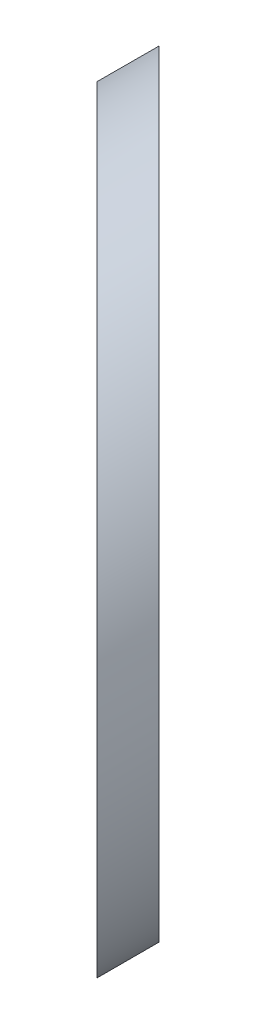
ISO-10303-21;
HEADER;
FILE_DESCRIPTION(('STEP AP214'),'2;1');
FILE_NAME('part.step','',(''),(''),'','','');
FILE_SCHEMA(('AUTOMOTIVE_DESIGN { 1 0 10303 214 1 1 1 1 }'));
ENDSEC;
DATA;
#1=APPLICATION_CONTEXT('core data for automotive mechanical design processes');
#2=APPLICATION_PROTOCOL_DEFINITION('international standard','automotive_design',2000,#1);
#3=PRODUCT_CONTEXT('',#1,'mechanical');
#4=PRODUCT('Part','Part','',(#3));
#5=PRODUCT_RELATED_PRODUCT_CATEGORY('part','',(#4));
#6=PRODUCT_DEFINITION_FORMATION('','',#4);
#7=PRODUCT_DEFINITION_CONTEXT('part definition',#1,'design');
#8=PRODUCT_DEFINITION('design','',#6,#7);
#9=PRODUCT_DEFINITION_SHAPE('','',#8);
#10=(LENGTH_UNIT() NAMED_UNIT(*) SI_UNIT(.MILLI.,.METRE.));
#11=(NAMED_UNIT(*) PLANE_ANGLE_UNIT() SI_UNIT($,.RADIAN.));
#12=(NAMED_UNIT(*) SI_UNIT($,.STERADIAN.) SOLID_ANGLE_UNIT());
#13=UNCERTAINTY_MEASURE_WITH_UNIT(LENGTH_MEASURE(1.E-05),#10,'distance_accuracy_value','');
#14=(GEOMETRIC_REPRESENTATION_CONTEXT(3) GLOBAL_UNCERTAINTY_ASSIGNED_CONTEXT((#13)) GLOBAL_UNIT_ASSIGNED_CONTEXT((#10,
#11,#12)) REPRESENTATION_CONTEXT('',''));
#15=CARTESIAN_POINT('',(0.,0.,0.));
#16=DIRECTION('',(0.,0.,1.));
#17=DIRECTION('',(1.,0.,0.));
#18=AXIS2_PLACEMENT_3D('',#15,#16,#17);
#19=CARTESIAN_POINT('',(0.,0.,61.));
#20=DIRECTION('',(0.,0.,-1.));
#21=DIRECTION('',(-1.,0.,0.));
#22=AXIS2_PLACEMENT_3D('',#19,#20,#21);
#23=CYLINDRICAL_SURFACE('',#22,6.25);
#24=CARTESIAN_POINT('',(0.,0.,19.4480630350569));
#25=DIRECTION('',(0.707106781186546,0.,-0.707106781186549));
#26=DIRECTION('',(-0.707106781186549,0.,-0.707106781186546));
#27=AXIS2_PLACEMENT_3D('',#24,#25,#26);
#28=ELLIPSE('',#27,8.83883476483183,6.25);
#29=CARTESIAN_POINT('',(-6.25,0.,13.1980630350569));
#30=VERTEX_POINT('',#29);
#31=EDGE_CURVE('E12',#30,#30,#28,.T.);
#32=ORIENTED_EDGE('',*,*,#31,.T.);
#33=EDGE_LOOP('',(#32));
#34=FACE_BOUND('',#33,.T.);
#35=CARTESIAN_POINT('',(0.,0.,18.0338494726838));
#36=DIRECTION('',(-0.707106781186546,0.,0.707106781186549));
#37=DIRECTION('',(-0.707106781186549,0.,-0.707106781186546));
#38=AXIS2_PLACEMENT_3D('',#35,#36,#37);
#39=ELLIPSE('',#38,8.83883476483183,6.25);
#40=CARTESIAN_POINT('',(-6.25,0.,11.7838494726838));
#41=VERTEX_POINT('',#40);
#42=EDGE_CURVE('E60',#41,#41,#39,.T.);
#43=ORIENTED_EDGE('',*,*,#42,.T.);
#44=EDGE_LOOP('',(#43));
#45=FACE_BOUND('',#44,.T.);
#46=ADVANCED_FACE('F53',(#34,#45),#23,.T.);
#47=CARTESIAN_POINT('',(-39.378340461429,-30.5,-21.3444909887451));
#48=DIRECTION('',(-0.707106781186546,0.,0.707106781186549));
#49=DIRECTION('',(0.707106781186549,0.,0.707106781186546));
#50=AXIS2_PLACEMENT_3D('',#47,#48,#49);
#51=PLANE('',#50);
#52=ORIENTED_EDGE('',*,*,#42,.F.);
#53=EDGE_LOOP('',(#52));
#54=FACE_BOUND('',#53,.T.);
#55=ADVANCED_FACE('F70',(#54),#51,.F.);
#56=CARTESIAN_POINT('',(-40.0854472426156,-30.5,-20.6373842075585));
#57=DIRECTION('',(0.707106781186546,0.,-0.707106781186549));
#58=DIRECTION('',(-0.707106781186549,0.,-0.707106781186546));
#59=AXIS2_PLACEMENT_3D('',#56,#57,#58);
#60=PLANE('',#59);
#61=ORIENTED_EDGE('',*,*,#31,.F.);
#62=EDGE_LOOP('',(#61));
#63=FACE_BOUND('',#62,.T.);
#64=ADVANCED_FACE('F72',(#63),#60,.F.);
#65=CLOSED_SHELL('',(#46,#55,#64));
#66=MANIFOLD_SOLID_BREP('B2',#65);
#67=ADVANCED_BREP_SHAPE_REPRESENTATION('',(#18,#66),#14);
#68=SHAPE_DEFINITION_REPRESENTATION(#9,#67);
ENDSEC;
END-ISO-10303-21;
